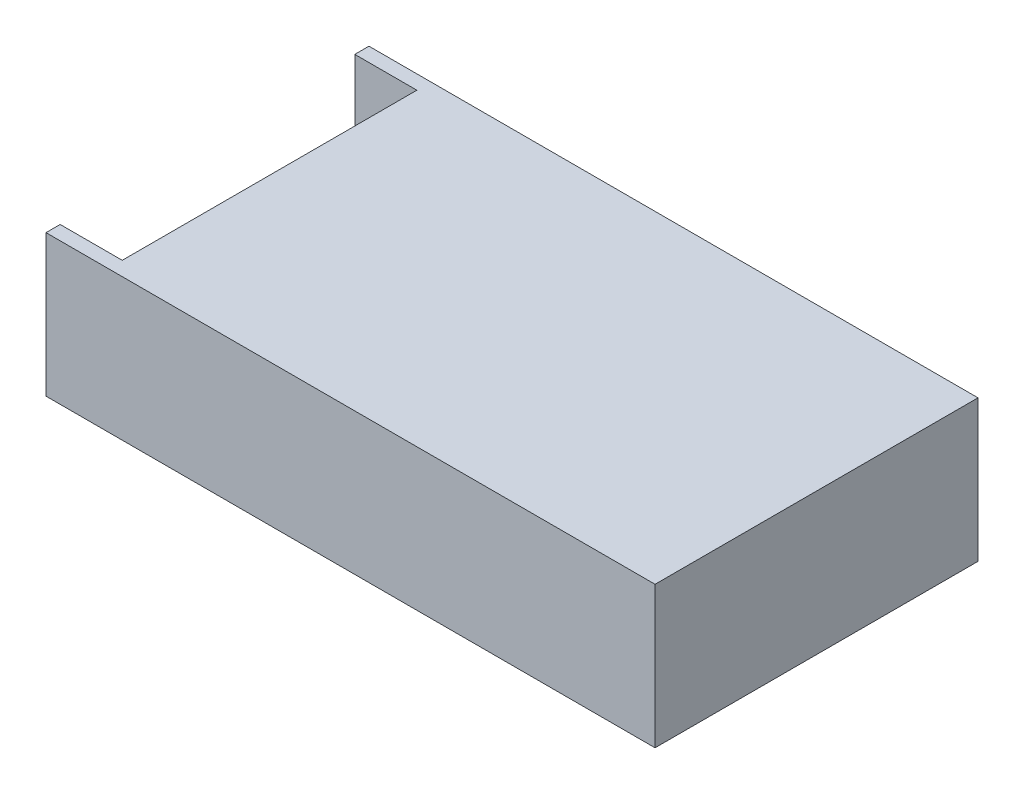
ISO-10303-21;
HEADER;
FILE_DESCRIPTION(('STEP AP214'),'2;1');
FILE_NAME('part.step','',(''),(''),'','','');
FILE_SCHEMA(('AUTOMOTIVE_DESIGN { 1 0 10303 214 1 1 1 1 }'));
ENDSEC;
DATA;
#1=APPLICATION_CONTEXT('core data for automotive mechanical design processes');
#2=APPLICATION_PROTOCOL_DEFINITION('international standard','automotive_design',2000,#1);
#3=PRODUCT_CONTEXT('',#1,'mechanical');
#4=PRODUCT('Part','Part','',(#3));
#5=PRODUCT_RELATED_PRODUCT_CATEGORY('part','',(#4));
#6=PRODUCT_DEFINITION_FORMATION('','',#4);
#7=PRODUCT_DEFINITION_CONTEXT('part definition',#1,'design');
#8=PRODUCT_DEFINITION('design','',#6,#7);
#9=PRODUCT_DEFINITION_SHAPE('','',#8);
#10=(LENGTH_UNIT() NAMED_UNIT(*) SI_UNIT(.MILLI.,.METRE.));
#11=(NAMED_UNIT(*) PLANE_ANGLE_UNIT() SI_UNIT($,.RADIAN.));
#12=(NAMED_UNIT(*) SI_UNIT($,.STERADIAN.) SOLID_ANGLE_UNIT());
#13=UNCERTAINTY_MEASURE_WITH_UNIT(LENGTH_MEASURE(1.E-05),#10,'distance_accuracy_value','');
#14=(GEOMETRIC_REPRESENTATION_CONTEXT(3) GLOBAL_UNCERTAINTY_ASSIGNED_CONTEXT((#13)) GLOBAL_UNIT_ASSIGNED_CONTEXT((#10,
#11,#12)) REPRESENTATION_CONTEXT('',''));
#15=CARTESIAN_POINT('',(0.,0.,0.));
#16=DIRECTION('',(0.,0.,1.));
#17=DIRECTION('',(1.,0.,0.));
#18=AXIS2_PLACEMENT_3D('',#15,#16,#17);
#19=CARTESIAN_POINT('',(-107.5,50.,-57.));
#20=DIRECTION('',(1.,0.,0.));
#21=DIRECTION('',(0.,0.,-1.));
#22=AXIS2_PLACEMENT_3D('',#19,#20,#21);
#23=PLANE('',#22);
#24=DIRECTION('',(0.,-1.,0.));
#25=VECTOR('',#24,1.);
#26=CARTESIAN_POINT('',(-107.5,6.42688909164235,52.));
#27=LINE('',#26,#25);
#28=CARTESIAN_POINT('',(-107.5,50.,52.));
#29=VERTEX_POINT('',#28);
#30=CARTESIAN_POINT('',(-107.5,6.42688909164235,52.));
#31=VERTEX_POINT('',#30);
#32=EDGE_CURVE('E138',#29,#31,#27,.T.);
#33=ORIENTED_EDGE('',*,*,#32,.T.);
#34=DIRECTION('',(0.,0.,1.));
#35=VECTOR('',#34,1.);
#36=CARTESIAN_POINT('',(-107.5,6.42688909164235,-105.773690868953));
#37=LINE('',#36,#35);
#38=CARTESIAN_POINT('',(-107.5,6.42688909164235,-52.));
#39=VERTEX_POINT('',#38);
#40=EDGE_CURVE('E120',#39,#31,#37,.T.);
#41=ORIENTED_EDGE('',*,*,#40,.F.);
#42=DIRECTION('',(0.,1.,0.));
#43=VECTOR('',#42,1.);
#44=CARTESIAN_POINT('',(-107.5,6.42688909164235,-52.));
#45=LINE('',#44,#43);
#46=CARTESIAN_POINT('',(-107.5,50.,-52.));
#47=VERTEX_POINT('',#46);
#48=EDGE_CURVE('E169',#39,#47,#45,.T.);
#49=ORIENTED_EDGE('',*,*,#48,.T.);
#50=DIRECTION('',(0.,0.,1.));
#51=VECTOR('',#50,1.);
#52=CARTESIAN_POINT('',(-107.5,50.,-57.));
#53=LINE('',#52,#51);
#54=CARTESIAN_POINT('',(-107.5,50.,-57.));
#55=VERTEX_POINT('',#54);
#56=EDGE_CURVE('E175',#55,#47,#53,.T.);
#57=ORIENTED_EDGE('',*,*,#56,.F.);
#58=DIRECTION('',(0.,-1.,0.));
#59=VECTOR('',#58,1.);
#60=CARTESIAN_POINT('',(-107.5,50.,-57.));
#61=LINE('',#60,#59);
#62=CARTESIAN_POINT('',(-107.5,0.,-57.));
#63=VERTEX_POINT('',#62);
#64=EDGE_CURVE('E42',#55,#63,#61,.T.);
#65=ORIENTED_EDGE('',*,*,#64,.T.);
#66=DIRECTION('',(0.,0.,1.));
#67=VECTOR('',#66,1.);
#68=CARTESIAN_POINT('',(-107.5,0.,-57.));
#69=LINE('',#68,#67);
#70=CARTESIAN_POINT('',(-107.5,0.,57.));
#71=VERTEX_POINT('',#70);
#72=EDGE_CURVE('E184',#63,#71,#69,.T.);
#73=ORIENTED_EDGE('',*,*,#72,.T.);
#74=DIRECTION('',(0.,-1.,0.));
#75=VECTOR('',#74,1.);
#76=CARTESIAN_POINT('',(-107.5,50.,57.));
#77=LINE('',#76,#75);
#78=CARTESIAN_POINT('',(-107.5,50.,57.));
#79=VERTEX_POINT('',#78);
#80=EDGE_CURVE('E188',#79,#71,#77,.T.);
#81=ORIENTED_EDGE('',*,*,#80,.F.);
#82=EDGE_CURVE('E146',#29,#79,#53,.T.);
#83=ORIENTED_EDGE('',*,*,#82,.F.);
#84=EDGE_LOOP('',(#33,#41,#49,#57,#65,#73,#81,#83));
#85=FACE_BOUND('',#84,.T.);
#86=ADVANCED_FACE('F34',(#85),#23,.F.);
#87=CARTESIAN_POINT('',(0.,50.,0.));
#88=DIRECTION('',(0.,1.,0.));
#89=DIRECTION('',(0.,0.,1.));
#90=AXIS2_PLACEMENT_3D('',#87,#88,#89);
#91=PLANE('',#90);
#92=DIRECTION('',(0.,0.,1.));
#93=VECTOR('',#92,1.);
#94=CARTESIAN_POINT('',(-85.5852349602344,50.,-105.773690868953));
#95=LINE('',#94,#93);
#96=CARTESIAN_POINT('',(-85.5852349602344,50.,-52.));
#97=VERTEX_POINT('',#96);
#98=CARTESIAN_POINT('',(-85.5852349602344,50.,52.));
#99=VERTEX_POINT('',#98);
#100=EDGE_CURVE('E49',#97,#99,#95,.T.);
#101=ORIENTED_EDGE('',*,*,#100,.T.);
#102=DIRECTION('',(-1.,0.,0.));
#103=VECTOR('',#102,1.);
#104=CARTESIAN_POINT('',(-107.5,50.,52.));
#105=LINE('',#104,#103);
#106=EDGE_CURVE('E132',#99,#29,#105,.T.);
#107=ORIENTED_EDGE('',*,*,#106,.T.);
#108=ORIENTED_EDGE('',*,*,#82,.T.);
#109=DIRECTION('',(1.,0.,0.));
#110=VECTOR('',#109,1.);
#111=CARTESIAN_POINT('',(-107.5,50.,57.));
#112=LINE('',#111,#110);
#113=CARTESIAN_POINT('',(107.5,50.,57.));
#114=VERTEX_POINT('',#113);
#115=EDGE_CURVE('E58',#79,#114,#112,.T.);
#116=ORIENTED_EDGE('',*,*,#115,.T.);
#117=DIRECTION('',(0.,0.,-1.));
#118=VECTOR('',#117,1.);
#119=CARTESIAN_POINT('',(107.5,50.,-57.));
#120=LINE('',#119,#118);
#121=CARTESIAN_POINT('',(107.5,50.,-57.));
#122=VERTEX_POINT('',#121);
#123=EDGE_CURVE('E172',#114,#122,#120,.T.);
#124=ORIENTED_EDGE('',*,*,#123,.T.);
#125=DIRECTION('',(-1.,0.,0.));
#126=VECTOR('',#125,1.);
#127=CARTESIAN_POINT('',(-107.5,50.,-57.));
#128=LINE('',#127,#126);
#129=EDGE_CURVE('E86',#122,#55,#128,.T.);
#130=ORIENTED_EDGE('',*,*,#129,.T.);
#131=ORIENTED_EDGE('',*,*,#56,.T.);
#132=DIRECTION('',(1.,0.,0.));
#133=VECTOR('',#132,1.);
#134=CARTESIAN_POINT('',(-107.5,50.,-52.));
#135=LINE('',#134,#133);
#136=EDGE_CURVE('E153',#47,#97,#135,.T.);
#137=ORIENTED_EDGE('',*,*,#136,.T.);
#138=EDGE_LOOP('',(#101,#107,#108,#116,#124,#130,#131,#137));
#139=FACE_BOUND('',#138,.T.);
#140=ADVANCED_FACE('F211',(#139),#91,.T.);
#141=CARTESIAN_POINT('',(107.5,50.,-57.));
#142=DIRECTION('',(-1.,0.,0.));
#143=DIRECTION('',(0.,0.,1.));
#144=AXIS2_PLACEMENT_3D('',#141,#142,#143);
#145=PLANE('',#144);
#146=DIRECTION('',(0.,0.,-1.));
#147=VECTOR('',#146,1.);
#148=CARTESIAN_POINT('',(107.5,0.,-57.));
#149=LINE('',#148,#147);
#150=CARTESIAN_POINT('',(107.5,0.,57.));
#151=VERTEX_POINT('',#150);
#152=CARTESIAN_POINT('',(107.5,0.,-57.));
#153=VERTEX_POINT('',#152);
#154=EDGE_CURVE('E171',#151,#153,#149,.T.);
#155=ORIENTED_EDGE('',*,*,#154,.T.);
#156=DIRECTION('',(0.,-1.,0.));
#157=VECTOR('',#156,1.);
#158=CARTESIAN_POINT('',(107.5,50.,-57.));
#159=LINE('',#158,#157);
#160=EDGE_CURVE('E12',#122,#153,#159,.T.);
#161=ORIENTED_EDGE('',*,*,#160,.F.);
#162=ORIENTED_EDGE('',*,*,#123,.F.);
#163=DIRECTION('',(0.,-1.,0.));
#164=VECTOR('',#163,1.);
#165=CARTESIAN_POINT('',(107.5,50.,57.));
#166=LINE('',#165,#164);
#167=EDGE_CURVE('E179',#114,#151,#166,.T.);
#168=ORIENTED_EDGE('',*,*,#167,.T.);
#169=EDGE_LOOP('',(#155,#161,#162,#168));
#170=FACE_BOUND('',#169,.T.);
#171=ADVANCED_FACE('F36',(#170),#145,.F.);
#172=CARTESIAN_POINT('',(-107.5,50.,-57.));
#173=DIRECTION('',(0.,0.,1.));
#174=DIRECTION('',(1.,0.,0.));
#175=AXIS2_PLACEMENT_3D('',#172,#173,#174);
#176=PLANE('',#175);
#177=DIRECTION('',(-1.,0.,0.));
#178=VECTOR('',#177,1.);
#179=CARTESIAN_POINT('',(-107.5,0.,-57.));
#180=LINE('',#179,#178);
#181=EDGE_CURVE('E182',#153,#63,#180,.T.);
#182=ORIENTED_EDGE('',*,*,#181,.T.);
#183=ORIENTED_EDGE('',*,*,#64,.F.);
#184=ORIENTED_EDGE('',*,*,#129,.F.);
#185=ORIENTED_EDGE('',*,*,#160,.T.);
#186=EDGE_LOOP('',(#182,#183,#184,#185));
#187=FACE_BOUND('',#186,.T.);
#188=ADVANCED_FACE('F200',(#187),#176,.F.);
#189=CARTESIAN_POINT('',(-107.5,50.,57.));
#190=DIRECTION('',(0.,0.,-1.));
#191=DIRECTION('',(-1.,0.,0.));
#192=AXIS2_PLACEMENT_3D('',#189,#190,#191);
#193=PLANE('',#192);
#194=DIRECTION('',(1.,0.,0.));
#195=VECTOR('',#194,1.);
#196=CARTESIAN_POINT('',(-107.5,0.,57.));
#197=LINE('',#196,#195);
#198=EDGE_CURVE('E79',#71,#151,#197,.T.);
#199=ORIENTED_EDGE('',*,*,#198,.T.);
#200=ORIENTED_EDGE('',*,*,#167,.F.);
#201=ORIENTED_EDGE('',*,*,#115,.F.);
#202=ORIENTED_EDGE('',*,*,#80,.T.);
#203=EDGE_LOOP('',(#199,#200,#201,#202));
#204=FACE_BOUND('',#203,.T.);
#205=ADVANCED_FACE('F198',(#204),#193,.F.);
#206=CARTESIAN_POINT('',(0.,0.,0.));
#207=DIRECTION('',(0.,1.,0.));
#208=DIRECTION('',(0.,0.,1.));
#209=AXIS2_PLACEMENT_3D('',#206,#207,#208);
#210=PLANE('',#209);
#211=CARTESIAN_POINT('',(-29.6,0.,42.));
#212=DIRECTION('',(0.,-1.,0.));
#213=DIRECTION('',(0.,0.,-1.));
#214=AXIS2_PLACEMENT_3D('',#211,#212,#213);
#215=CIRCLE('',#214,2.);
#216=CARTESIAN_POINT('',(-29.6,0.,40.));
#217=VERTEX_POINT('',#216);
#218=EDGE_CURVE('E274',#217,#217,#215,.T.);
#219=ORIENTED_EDGE('',*,*,#218,.F.);
#220=EDGE_LOOP('',(#219));
#221=FACE_BOUND('',#220,.T.);
#222=CARTESIAN_POINT('',(-29.6,0.,-43.));
#223=DIRECTION('',(0.,-1.,0.));
#224=DIRECTION('',(0.,0.,-1.));
#225=AXIS2_PLACEMENT_3D('',#222,#223,#224);
#226=CIRCLE('',#225,2.);
#227=CARTESIAN_POINT('',(-29.6,0.,-45.));
#228=VERTEX_POINT('',#227);
#229=EDGE_CURVE('E284',#228,#228,#226,.T.);
#230=ORIENTED_EDGE('',*,*,#229,.F.);
#231=EDGE_LOOP('',(#230));
#232=FACE_BOUND('',#231,.T.);
#233=CARTESIAN_POINT('',(96.,0.,-43.));
#234=DIRECTION('',(0.,-1.,0.));
#235=DIRECTION('',(0.,0.,-1.));
#236=AXIS2_PLACEMENT_3D('',#233,#234,#235);
#237=CIRCLE('',#236,2.);
#238=CARTESIAN_POINT('',(96.,0.,-45.));
#239=VERTEX_POINT('',#238);
#240=EDGE_CURVE('E290',#239,#239,#237,.T.);
#241=ORIENTED_EDGE('',*,*,#240,.F.);
#242=EDGE_LOOP('',(#241));
#243=FACE_BOUND('',#242,.T.);
#244=CARTESIAN_POINT('',(96.,0.,42.));
#245=DIRECTION('',(0.,-1.,0.));
#246=DIRECTION('',(0.,0.,-1.));
#247=AXIS2_PLACEMENT_3D('',#244,#245,#246);
#248=CIRCLE('',#247,2.);
#249=CARTESIAN_POINT('',(96.,0.,40.));
#250=VERTEX_POINT('',#249);
#251=EDGE_CURVE('E150',#250,#250,#248,.T.);
#252=ORIENTED_EDGE('',*,*,#251,.F.);
#253=EDGE_LOOP('',(#252));
#254=FACE_BOUND('',#253,.T.);
#255=ORIENTED_EDGE('',*,*,#154,.F.);
#256=ORIENTED_EDGE('',*,*,#198,.F.);
#257=ORIENTED_EDGE('',*,*,#72,.F.);
#258=ORIENTED_EDGE('',*,*,#181,.F.);
#259=EDGE_LOOP('',(#255,#256,#257,#258));
#260=FACE_BOUND('',#259,.T.);
#261=ADVANCED_FACE('F194',(#221,#232,#243,#254,#260),#210,.F.);
#262=CARTESIAN_POINT('',(-85.5852349602344,50.,-105.773690868953));
#263=DIRECTION('',(1.,0.,0.));
#264=DIRECTION('',(0.,0.,-1.));
#265=AXIS2_PLACEMENT_3D('',#262,#263,#264);
#266=PLANE('',#265);
#267=DIRECTION('',(0.,-1.,0.));
#268=VECTOR('',#267,1.);
#269=CARTESIAN_POINT('',(-85.5852349602344,50.,-52.));
#270=LINE('',#269,#268);
#271=CARTESIAN_POINT('',(-85.5852349602344,16.1338908097548,-52.));
#272=VERTEX_POINT('',#271);
#273=EDGE_CURVE('E297',#97,#272,#270,.T.);
#274=ORIENTED_EDGE('',*,*,#273,.T.);
#275=DIRECTION('',(0.,0.,1.));
#276=VECTOR('',#275,1.);
#277=CARTESIAN_POINT('',(-85.5852349602344,16.1338908097548,-105.773690868953));
#278=LINE('',#277,#276);
#279=CARTESIAN_POINT('',(-85.5852349602344,16.1338908097548,52.));
#280=VERTEX_POINT('',#279);
#281=EDGE_CURVE('E164',#272,#280,#278,.T.);
#282=ORIENTED_EDGE('',*,*,#281,.T.);
#283=DIRECTION('',(0.,1.,0.));
#284=VECTOR('',#283,1.);
#285=CARTESIAN_POINT('',(-85.5852349602344,50.,52.));
#286=LINE('',#285,#284);
#287=EDGE_CURVE('E160',#280,#99,#286,.T.);
#288=ORIENTED_EDGE('',*,*,#287,.T.);
#289=ORIENTED_EDGE('',*,*,#100,.F.);
#290=EDGE_LOOP('',(#274,#282,#288,#289));
#291=FACE_BOUND('',#290,.T.);
#292=ADVANCED_FACE('F206',(#291),#266,.F.);
#293=CARTESIAN_POINT('',(-102.483117777339,16.1338908097548,-105.773690868953));
#294=DIRECTION('',(0.,-1.,0.));
#295=DIRECTION('',(0.,0.,-1.));
#296=AXIS2_PLACEMENT_3D('',#293,#294,#295);
#297=PLANE('',#296);
#298=DIRECTION('',(-1.,0.,0.));
#299=VECTOR('',#298,1.);
#300=CARTESIAN_POINT('',(-102.483117777339,16.1338908097548,-52.));
#301=LINE('',#300,#299);
#302=CARTESIAN_POINT('',(-102.483117777339,16.1338908097548,-52.));
#303=VERTEX_POINT('',#302);
#304=EDGE_CURVE('E296',#272,#303,#301,.T.);
#305=ORIENTED_EDGE('',*,*,#304,.T.);
#306=DIRECTION('',(0.,0.,1.));
#307=VECTOR('',#306,1.);
#308=CARTESIAN_POINT('',(-102.483117777339,16.1338908097548,-105.773690868953));
#309=LINE('',#308,#307);
#310=CARTESIAN_POINT('',(-102.483117777339,16.1338908097548,52.));
#311=VERTEX_POINT('',#310);
#312=EDGE_CURVE('E166',#303,#311,#309,.T.);
#313=ORIENTED_EDGE('',*,*,#312,.T.);
#314=DIRECTION('',(1.,0.,0.));
#315=VECTOR('',#314,1.);
#316=CARTESIAN_POINT('',(-102.483117777339,16.1338908097548,52.));
#317=LINE('',#316,#315);
#318=EDGE_CURVE('E157',#311,#280,#317,.T.);
#319=ORIENTED_EDGE('',*,*,#318,.T.);
#320=ORIENTED_EDGE('',*,*,#281,.F.);
#321=EDGE_LOOP('',(#305,#313,#319,#320));
#322=FACE_BOUND('',#321,.T.);
#323=ADVANCED_FACE('F225',(#322),#297,.F.);
#324=CARTESIAN_POINT('',(-102.483117777339,6.42688909164235,-105.773690868953));
#325=DIRECTION('',(1.,0.,0.));
#326=DIRECTION('',(0.,0.,-1.));
#327=AXIS2_PLACEMENT_3D('',#324,#325,#326);
#328=PLANE('',#327);
#329=DIRECTION('',(0.,-1.,0.));
#330=VECTOR('',#329,1.);
#331=CARTESIAN_POINT('',(-102.483117777339,6.42688909164235,-52.));
#332=LINE('',#331,#330);
#333=CARTESIAN_POINT('',(-102.483117777339,6.42688909164235,-52.));
#334=VERTEX_POINT('',#333);
#335=EDGE_CURVE('E294',#303,#334,#332,.T.);
#336=ORIENTED_EDGE('',*,*,#335,.T.);
#337=DIRECTION('',(0.,0.,1.));
#338=VECTOR('',#337,1.);
#339=CARTESIAN_POINT('',(-102.483117777339,6.42688909164235,-105.773690868953));
#340=LINE('',#339,#338);
#341=CARTESIAN_POINT('',(-102.483117777339,6.42688909164235,52.));
#342=VERTEX_POINT('',#341);
#343=EDGE_CURVE('E131',#334,#342,#340,.T.);
#344=ORIENTED_EDGE('',*,*,#343,.T.);
#345=DIRECTION('',(0.,1.,0.));
#346=VECTOR('',#345,1.);
#347=CARTESIAN_POINT('',(-102.483117777339,6.42688909164235,52.));
#348=LINE('',#347,#346);
#349=EDGE_CURVE('E142',#342,#311,#348,.T.);
#350=ORIENTED_EDGE('',*,*,#349,.T.);
#351=ORIENTED_EDGE('',*,*,#312,.F.);
#352=EDGE_LOOP('',(#336,#344,#350,#351));
#353=FACE_BOUND('',#352,.T.);
#354=ADVANCED_FACE('F222',(#353),#328,.F.);
#355=CARTESIAN_POINT('',(-102.483117777339,6.42688909164235,-105.773690868953));
#356=DIRECTION('',(0.,-1.,0.));
#357=DIRECTION('',(0.,0.,-1.));
#358=AXIS2_PLACEMENT_3D('',#355,#356,#357);
#359=PLANE('',#358);
#360=DIRECTION('',(-1.,0.,0.));
#361=VECTOR('',#360,1.);
#362=CARTESIAN_POINT('',(-102.483117777339,6.42688909164235,-52.));
#363=LINE('',#362,#361);
#364=EDGE_CURVE('E126',#334,#39,#363,.T.);
#365=ORIENTED_EDGE('',*,*,#364,.T.);
#366=ORIENTED_EDGE('',*,*,#40,.T.);
#367=DIRECTION('',(1.,0.,0.));
#368=VECTOR('',#367,1.);
#369=CARTESIAN_POINT('',(-102.483117777339,6.42688909164235,52.));
#370=LINE('',#369,#368);
#371=EDGE_CURVE('E124',#31,#342,#370,.T.);
#372=ORIENTED_EDGE('',*,*,#371,.T.);
#373=ORIENTED_EDGE('',*,*,#343,.F.);
#374=EDGE_LOOP('',(#365,#366,#372,#373));
#375=FACE_BOUND('',#374,.T.);
#376=ADVANCED_FACE('F122',(#375),#359,.F.);
#377=CARTESIAN_POINT('',(0.,0.,52.));
#378=DIRECTION('',(0.,0.,-1.));
#379=DIRECTION('',(-1.,0.,0.));
#380=AXIS2_PLACEMENT_3D('',#377,#378,#379);
#381=PLANE('',#380);
#382=ORIENTED_EDGE('',*,*,#106,.F.);
#383=ORIENTED_EDGE('',*,*,#287,.F.);
#384=ORIENTED_EDGE('',*,*,#318,.F.);
#385=ORIENTED_EDGE('',*,*,#349,.F.);
#386=ORIENTED_EDGE('',*,*,#371,.F.);
#387=ORIENTED_EDGE('',*,*,#32,.F.);
#388=EDGE_LOOP('',(#382,#383,#384,#385,#386,#387));
#389=FACE_BOUND('',#388,.T.);
#390=ADVANCED_FACE('F137',(#389),#381,.T.);
#391=CARTESIAN_POINT('',(-107.5,50.,-52.));
#392=DIRECTION('',(0.,0.,1.));
#393=DIRECTION('',(1.,0.,0.));
#394=AXIS2_PLACEMENT_3D('',#391,#392,#393);
#395=PLANE('',#394);
#396=ORIENTED_EDGE('',*,*,#136,.F.);
#397=ORIENTED_EDGE('',*,*,#48,.F.);
#398=ORIENTED_EDGE('',*,*,#364,.F.);
#399=ORIENTED_EDGE('',*,*,#335,.F.);
#400=ORIENTED_EDGE('',*,*,#304,.F.);
#401=ORIENTED_EDGE('',*,*,#273,.F.);
#402=EDGE_LOOP('',(#396,#397,#398,#399,#400,#401));
#403=FACE_BOUND('',#402,.T.);
#404=ADVANCED_FACE('F234',(#403),#395,.T.);
#405=CARTESIAN_POINT('',(96.,10.,42.));
#406=DIRECTION('',(0.,-1.,0.));
#407=DIRECTION('',(0.,0.,-1.));
#408=AXIS2_PLACEMENT_3D('',#405,#406,#407);
#409=CYLINDRICAL_SURFACE('',#408,2.);
#410=CARTESIAN_POINT('',(96.,10.,42.));
#411=DIRECTION('',(0.,-1.,0.));
#412=DIRECTION('',(0.,0.,-1.));
#413=AXIS2_PLACEMENT_3D('',#410,#411,#412);
#414=CIRCLE('',#413,2.);
#415=CARTESIAN_POINT('',(96.,10.,40.));
#416=VERTEX_POINT('',#415);
#417=EDGE_CURVE('E147',#416,#416,#414,.T.);
#418=ORIENTED_EDGE('',*,*,#417,.F.);
#419=EDGE_LOOP('',(#418));
#420=FACE_BOUND('',#419,.T.);
#421=ORIENTED_EDGE('',*,*,#251,.T.);
#422=EDGE_LOOP('',(#421));
#423=FACE_BOUND('',#422,.T.);
#424=ADVANCED_FACE('F237',(#420,#423),#409,.F.);
#425=CARTESIAN_POINT('',(96.,10.,42.));
#426=DIRECTION('',(0.,-1.,0.));
#427=DIRECTION('',(0.,0.,-1.));
#428=AXIS2_PLACEMENT_3D('',#425,#426,#427);
#429=PLANE('',#428);
#430=ORIENTED_EDGE('',*,*,#417,.T.);
#431=EDGE_LOOP('',(#430));
#432=FACE_BOUND('',#431,.T.);
#433=ADVANCED_FACE('F241',(#432),#429,.T.);
#434=CARTESIAN_POINT('',(96.,10.,-43.));
#435=DIRECTION('',(0.,-1.,0.));
#436=DIRECTION('',(0.,0.,-1.));
#437=AXIS2_PLACEMENT_3D('',#434,#435,#436);
#438=CYLINDRICAL_SURFACE('',#437,2.);
#439=CARTESIAN_POINT('',(96.,10.,-43.));
#440=DIRECTION('',(0.,-1.,0.));
#441=DIRECTION('',(0.,0.,-1.));
#442=AXIS2_PLACEMENT_3D('',#439,#440,#441);
#443=CIRCLE('',#442,2.);
#444=CARTESIAN_POINT('',(96.,10.,-45.));
#445=VERTEX_POINT('',#444);
#446=EDGE_CURVE('E287',#445,#445,#443,.T.);
#447=ORIENTED_EDGE('',*,*,#446,.F.);
#448=EDGE_LOOP('',(#447));
#449=FACE_BOUND('',#448,.T.);
#450=ORIENTED_EDGE('',*,*,#240,.T.);
#451=EDGE_LOOP('',(#450));
#452=FACE_BOUND('',#451,.T.);
#453=ADVANCED_FACE('F245',(#449,#452),#438,.F.);
#454=CARTESIAN_POINT('',(96.,10.,-43.));
#455=DIRECTION('',(0.,-1.,0.));
#456=DIRECTION('',(0.,0.,-1.));
#457=AXIS2_PLACEMENT_3D('',#454,#455,#456);
#458=PLANE('',#457);
#459=ORIENTED_EDGE('',*,*,#446,.T.);
#460=EDGE_LOOP('',(#459));
#461=FACE_BOUND('',#460,.T.);
#462=ADVANCED_FACE('F249',(#461),#458,.T.);
#463=CARTESIAN_POINT('',(-29.6,10.,-43.));
#464=DIRECTION('',(0.,-1.,0.));
#465=DIRECTION('',(0.,0.,-1.));
#466=AXIS2_PLACEMENT_3D('',#463,#464,#465);
#467=CYLINDRICAL_SURFACE('',#466,2.);
#468=CARTESIAN_POINT('',(-29.6,10.,-43.));
#469=DIRECTION('',(0.,-1.,0.));
#470=DIRECTION('',(0.,0.,-1.));
#471=AXIS2_PLACEMENT_3D('',#468,#469,#470);
#472=CIRCLE('',#471,2.);
#473=CARTESIAN_POINT('',(-29.6,10.,-45.));
#474=VERTEX_POINT('',#473);
#475=EDGE_CURVE('E279',#474,#474,#472,.T.);
#476=ORIENTED_EDGE('',*,*,#475,.F.);
#477=EDGE_LOOP('',(#476));
#478=FACE_BOUND('',#477,.T.);
#479=ORIENTED_EDGE('',*,*,#229,.T.);
#480=EDGE_LOOP('',(#479));
#481=FACE_BOUND('',#480,.T.);
#482=ADVANCED_FACE('F253',(#478,#481),#467,.F.);
#483=CARTESIAN_POINT('',(-29.6,10.,-43.));
#484=DIRECTION('',(0.,-1.,0.));
#485=DIRECTION('',(0.,0.,-1.));
#486=AXIS2_PLACEMENT_3D('',#483,#484,#485);
#487=PLANE('',#486);
#488=ORIENTED_EDGE('',*,*,#475,.T.);
#489=EDGE_LOOP('',(#488));
#490=FACE_BOUND('',#489,.T.);
#491=ADVANCED_FACE('F257',(#490),#487,.T.);
#492=CARTESIAN_POINT('',(-29.6,10.,42.));
#493=DIRECTION('',(0.,-1.,0.));
#494=DIRECTION('',(0.,0.,-1.));
#495=AXIS2_PLACEMENT_3D('',#492,#493,#494);
#496=CYLINDRICAL_SURFACE('',#495,2.);
#497=CARTESIAN_POINT('',(-29.6,10.,42.));
#498=DIRECTION('',(0.,-1.,0.));
#499=DIRECTION('',(0.,0.,-1.));
#500=AXIS2_PLACEMENT_3D('',#497,#498,#499);
#501=CIRCLE('',#500,2.);
#502=CARTESIAN_POINT('',(-29.6,10.,40.));
#503=VERTEX_POINT('',#502);
#504=EDGE_CURVE('E273',#503,#503,#501,.T.);
#505=ORIENTED_EDGE('',*,*,#504,.F.);
#506=EDGE_LOOP('',(#505));
#507=FACE_BOUND('',#506,.T.);
#508=ORIENTED_EDGE('',*,*,#218,.T.);
#509=EDGE_LOOP('',(#508));
#510=FACE_BOUND('',#509,.T.);
#511=ADVANCED_FACE('F261',(#507,#510),#496,.F.);
#512=CARTESIAN_POINT('',(-29.6,10.,42.));
#513=DIRECTION('',(0.,-1.,0.));
#514=DIRECTION('',(0.,0.,-1.));
#515=AXIS2_PLACEMENT_3D('',#512,#513,#514);
#516=PLANE('',#515);
#517=ORIENTED_EDGE('',*,*,#504,.T.);
#518=EDGE_LOOP('',(#517));
#519=FACE_BOUND('',#518,.T.);
#520=ADVANCED_FACE('F265',(#519),#516,.T.);
#521=CLOSED_SHELL('',(#86,#140,#171,#188,#205,#261,#292,#323,#354,#376,#390,#404,#424,#433,#453,
#462,#482,#491,#511,#520));
#522=MANIFOLD_SOLID_BREP('B2',#521);
#523=ADVANCED_BREP_SHAPE_REPRESENTATION('',(#18,#522),#14);
#524=SHAPE_DEFINITION_REPRESENTATION(#9,#523);
ENDSEC;
END-ISO-10303-21;
